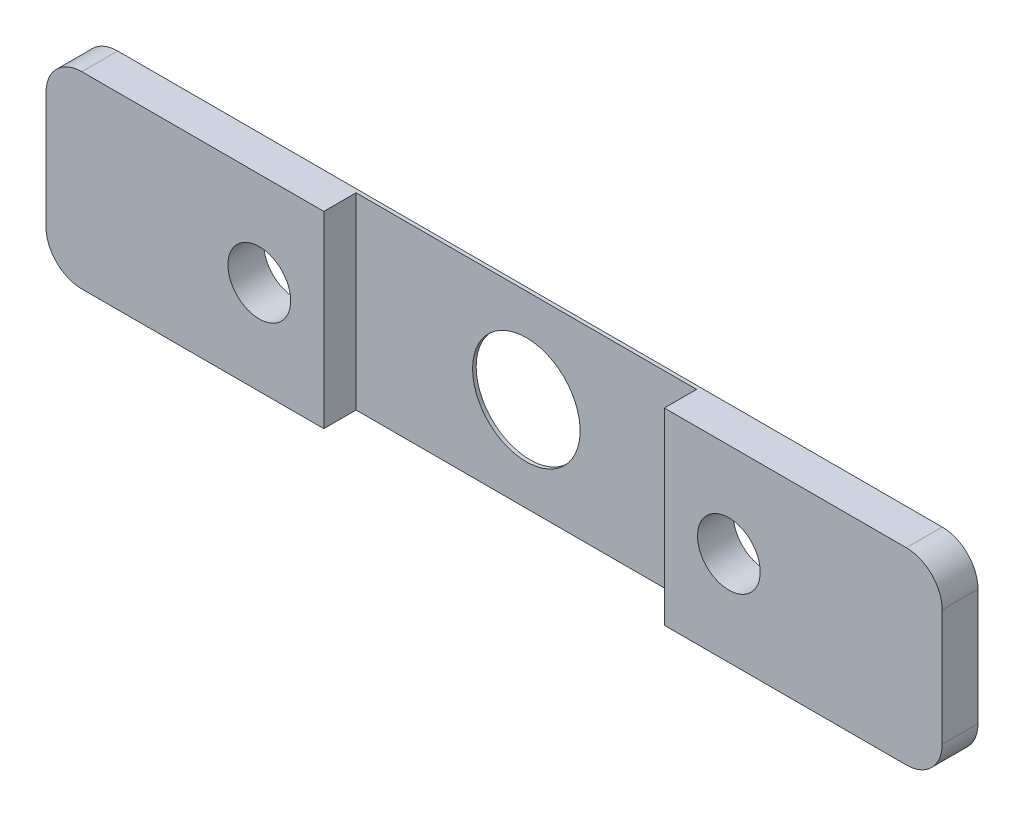
ISO-10303-21;
HEADER;
FILE_DESCRIPTION(('STEP AP214'),'2;1');
FILE_NAME('part.step','',(''),(''),'','','');
FILE_SCHEMA(('AUTOMOTIVE_DESIGN { 1 0 10303 214 1 1 1 1 }'));
ENDSEC;
DATA;
#1=APPLICATION_CONTEXT('core data for automotive mechanical design processes');
#2=APPLICATION_PROTOCOL_DEFINITION('international standard','automotive_design',2000,#1);
#3=PRODUCT_CONTEXT('',#1,'mechanical');
#4=PRODUCT('Part','Part','',(#3));
#5=PRODUCT_RELATED_PRODUCT_CATEGORY('part','',(#4));
#6=PRODUCT_DEFINITION_FORMATION('','',#4);
#7=PRODUCT_DEFINITION_CONTEXT('part definition',#1,'design');
#8=PRODUCT_DEFINITION('design','',#6,#7);
#9=PRODUCT_DEFINITION_SHAPE('','',#8);
#10=(LENGTH_UNIT() NAMED_UNIT(*) SI_UNIT(.MILLI.,.METRE.));
#11=(NAMED_UNIT(*) PLANE_ANGLE_UNIT() SI_UNIT($,.RADIAN.));
#12=(NAMED_UNIT(*) SI_UNIT($,.STERADIAN.) SOLID_ANGLE_UNIT());
#13=UNCERTAINTY_MEASURE_WITH_UNIT(LENGTH_MEASURE(1.E-05),#10,'distance_accuracy_value','');
#14=(GEOMETRIC_REPRESENTATION_CONTEXT(3) GLOBAL_UNCERTAINTY_ASSIGNED_CONTEXT((#13)) GLOBAL_UNIT_ASSIGNED_CONTEXT((#10,
#11,#12)) REPRESENTATION_CONTEXT('',''));
#15=CARTESIAN_POINT('',(0.,0.,0.));
#16=DIRECTION('',(0.,0.,1.));
#17=DIRECTION('',(1.,0.,0.));
#18=AXIS2_PLACEMENT_3D('',#15,#16,#17);
#19=CARTESIAN_POINT('',(0.,0.,2.));
#20=DIRECTION('',(0.,0.,-1.));
#21=DIRECTION('',(-1.,0.,0.));
#22=AXIS2_PLACEMENT_3D('',#19,#20,#21);
#23=PLANE('',#22);
#24=CARTESIAN_POINT('',(13.1,0.,2.));
#25=DIRECTION('',(0.,0.,1.));
#26=DIRECTION('',(1.,0.,0.));
#27=AXIS2_PLACEMENT_3D('',#24,#25,#26);
#28=CIRCLE('',#27,1.75);
#29=CARTESIAN_POINT('',(14.85,0.,2.));
#30=VERTEX_POINT('',#29);
#31=EDGE_CURVE('E164',#30,#30,#28,.T.);
#32=ORIENTED_EDGE('',*,*,#31,.F.);
#33=EDGE_LOOP('',(#32));
#34=FACE_BOUND('',#33,.T.);
#35=DIRECTION('',(-1.,0.,0.));
#36=VECTOR('',#35,1.);
#37=CARTESIAN_POINT('',(-25.,5.24999999999999,2.));
#38=LINE('',#37,#36);
#39=CARTESIAN_POINT('',(23.,5.24999999999999,2.));
#40=VERTEX_POINT('',#39);
#41=CARTESIAN_POINT('',(9.49999999999998,5.24999999999999,2.));
#42=VERTEX_POINT('',#41);
#43=EDGE_CURVE('E175',#40,#42,#38,.T.);
#44=ORIENTED_EDGE('',*,*,#43,.T.);
#45=DIRECTION('',(0.,1.,0.));
#46=VECTOR('',#45,1.);
#47=CARTESIAN_POINT('',(9.49999999999998,-5.24999999999999,2.));
#48=LINE('',#47,#46);
#49=CARTESIAN_POINT('',(9.49999999999998,-5.24999999999999,2.));
#50=VERTEX_POINT('',#49);
#51=EDGE_CURVE('E127',#50,#42,#48,.T.);
#52=ORIENTED_EDGE('',*,*,#51,.F.);
#53=DIRECTION('',(1.,0.,0.));
#54=VECTOR('',#53,1.);
#55=CARTESIAN_POINT('',(-25.,-5.25000000000001,2.));
#56=LINE('',#55,#54);
#57=CARTESIAN_POINT('',(23.,-5.24999999999999,2.));
#58=VERTEX_POINT('',#57);
#59=EDGE_CURVE('E56',#50,#58,#56,.T.);
#60=ORIENTED_EDGE('',*,*,#59,.T.);
#61=CARTESIAN_POINT('',(23.,-3.24999999999999,2.));
#62=DIRECTION('',(0.,0.,-1.));
#63=DIRECTION('',(-1.,0.,0.));
#64=AXIS2_PLACEMENT_3D('',#61,#62,#63);
#65=CIRCLE('',#64,2.);
#66=CARTESIAN_POINT('',(25.,-3.24999999999999,2.));
#67=VERTEX_POINT('',#66);
#68=EDGE_CURVE('E214',#58,#67,#65,.F.);
#69=ORIENTED_EDGE('',*,*,#68,.T.);
#70=DIRECTION('',(0.,1.,0.));
#71=VECTOR('',#70,1.);
#72=CARTESIAN_POINT('',(25.,-5.24999999999999,2.));
#73=LINE('',#72,#71);
#74=CARTESIAN_POINT('',(25.,3.24999999999999,2.));
#75=VERTEX_POINT('',#74);
#76=EDGE_CURVE('E170',#67,#75,#73,.T.);
#77=ORIENTED_EDGE('',*,*,#76,.T.);
#78=CARTESIAN_POINT('',(23.,3.24999999999999,2.));
#79=DIRECTION('',(0.,0.,-1.));
#80=DIRECTION('',(-1.,0.,0.));
#81=AXIS2_PLACEMENT_3D('',#78,#79,#80);
#82=CIRCLE('',#81,2.);
#83=EDGE_CURVE('E212',#75,#40,#82,.F.);
#84=ORIENTED_EDGE('',*,*,#83,.T.);
#85=EDGE_LOOP('',(#44,#52,#60,#69,#77,#84));
#86=FACE_BOUND('',#85,.T.);
#87=ADVANCED_FACE('F32',(#34,#86),#23,.F.);
#88=CARTESIAN_POINT('',(-23.,-5.25000000000001,2.));
#89=VERTEX_POINT('',#88);
#90=CARTESIAN_POINT('',(-9.50000000000002,-5.24999999999999,2.));
#91=VERTEX_POINT('',#90);
#92=EDGE_CURVE('E180',#89,#91,#56,.T.);
#93=ORIENTED_EDGE('',*,*,#92,.T.);
#94=DIRECTION('',(0.,-1.,0.));
#95=VECTOR('',#94,1.);
#96=CARTESIAN_POINT('',(-9.50000000000002,-5.24999999999999,2.));
#97=LINE('',#96,#95);
#98=CARTESIAN_POINT('',(-9.50000000000002,5.24999999999999,2.));
#99=VERTEX_POINT('',#98);
#100=EDGE_CURVE('E140',#99,#91,#97,.T.);
#101=ORIENTED_EDGE('',*,*,#100,.F.);
#102=CARTESIAN_POINT('',(-23.,5.24999999999999,2.));
#103=VERTEX_POINT('',#102);
#104=EDGE_CURVE('E173',#99,#103,#38,.T.);
#105=ORIENTED_EDGE('',*,*,#104,.T.);
#106=CARTESIAN_POINT('',(-23.,3.24999999999999,2.));
#107=DIRECTION('',(0.,0.,-1.));
#108=DIRECTION('',(-1.,0.,0.));
#109=AXIS2_PLACEMENT_3D('',#106,#107,#108);
#110=CIRCLE('',#109,2.);
#111=CARTESIAN_POINT('',(-25.,3.24999999999999,2.));
#112=VERTEX_POINT('',#111);
#113=EDGE_CURVE('E218',#103,#112,#110,.F.);
#114=ORIENTED_EDGE('',*,*,#113,.T.);
#115=DIRECTION('',(0.,-1.,0.));
#116=VECTOR('',#115,1.);
#117=CARTESIAN_POINT('',(-25.,-5.25000000000001,2.));
#118=LINE('',#117,#116);
#119=CARTESIAN_POINT('',(-25.,-3.25000000000001,2.));
#120=VERTEX_POINT('',#119);
#121=EDGE_CURVE('E177',#112,#120,#118,.T.);
#122=ORIENTED_EDGE('',*,*,#121,.T.);
#123=CARTESIAN_POINT('',(-23.,-3.25000000000001,2.));
#124=DIRECTION('',(0.,0.,-1.));
#125=DIRECTION('',(-1.,0.,0.));
#126=AXIS2_PLACEMENT_3D('',#123,#124,#125);
#127=CIRCLE('',#126,2.);
#128=EDGE_CURVE('E216',#120,#89,#127,.F.);
#129=ORIENTED_EDGE('',*,*,#128,.T.);
#130=EDGE_LOOP('',(#93,#101,#105,#114,#122,#129));
#131=FACE_BOUND('',#130,.T.);
#132=CARTESIAN_POINT('',(-13.1,0.,2.));
#133=DIRECTION('',(0.,0.,1.));
#134=DIRECTION('',(1.,0.,0.));
#135=AXIS2_PLACEMENT_3D('',#132,#133,#134);
#136=CIRCLE('',#135,1.75);
#137=CARTESIAN_POINT('',(-11.35,0.,2.));
#138=VERTEX_POINT('',#137);
#139=EDGE_CURVE('E158',#138,#138,#136,.T.);
#140=ORIENTED_EDGE('',*,*,#139,.F.);
#141=EDGE_LOOP('',(#140));
#142=FACE_BOUND('',#141,.T.);
#143=ADVANCED_FACE('F251',(#131,#142),#23,.F.);
#144=CARTESIAN_POINT('',(0.,0.,0.));
#145=DIRECTION('',(0.,0.,-1.));
#146=DIRECTION('',(-1.,0.,0.));
#147=AXIS2_PLACEMENT_3D('',#144,#145,#146);
#148=PLANE('',#147);
#149=CARTESIAN_POINT('',(0.,0.,0.));
#150=DIRECTION('',(0.,0.,-1.));
#151=DIRECTION('',(-1.,0.,0.));
#152=AXIS2_PLACEMENT_3D('',#149,#150,#151);
#153=CIRCLE('',#152,3.);
#154=CARTESIAN_POINT('',(-3.,0.,0.));
#155=VERTEX_POINT('',#154);
#156=EDGE_CURVE('E351',#155,#155,#153,.T.);
#157=ORIENTED_EDGE('',*,*,#156,.F.);
#158=EDGE_LOOP('',(#157));
#159=FACE_BOUND('',#158,.T.);
#160=CARTESIAN_POINT('',(13.1,0.,0.));
#161=DIRECTION('',(0.,0.,1.));
#162=DIRECTION('',(1.,0.,0.));
#163=AXIS2_PLACEMENT_3D('',#160,#161,#162);
#164=CIRCLE('',#163,1.75);
#165=CARTESIAN_POINT('',(14.85,0.,0.));
#166=VERTEX_POINT('',#165);
#167=EDGE_CURVE('E161',#166,#166,#164,.T.);
#168=ORIENTED_EDGE('',*,*,#167,.T.);
#169=EDGE_LOOP('',(#168));
#170=FACE_BOUND('',#169,.T.);
#171=DIRECTION('',(0.,-1.,0.));
#172=VECTOR('',#171,1.);
#173=CARTESIAN_POINT('',(-25.,-5.25000000000001,0.));
#174=LINE('',#173,#172);
#175=CARTESIAN_POINT('',(-25.,3.24999999999999,0.));
#176=VERTEX_POINT('',#175);
#177=CARTESIAN_POINT('',(-25.,-3.25000000000001,0.));
#178=VERTEX_POINT('',#177);
#179=EDGE_CURVE('E189',#176,#178,#174,.T.);
#180=ORIENTED_EDGE('',*,*,#179,.F.);
#181=CARTESIAN_POINT('',(-23.,3.24999999999999,0.));
#182=DIRECTION('',(0.,0.,-1.));
#183=DIRECTION('',(-1.,0.,0.));
#184=AXIS2_PLACEMENT_3D('',#181,#182,#183);
#185=CIRCLE('',#184,2.);
#186=CARTESIAN_POINT('',(-23.,5.24999999999999,0.));
#187=VERTEX_POINT('',#186);
#188=EDGE_CURVE('E204',#176,#187,#185,.T.);
#189=ORIENTED_EDGE('',*,*,#188,.T.);
#190=DIRECTION('',(-1.,0.,0.));
#191=VECTOR('',#190,1.);
#192=CARTESIAN_POINT('',(-25.,5.24999999999999,0.));
#193=LINE('',#192,#191);
#194=CARTESIAN_POINT('',(23.,5.24999999999999,0.));
#195=VERTEX_POINT('',#194);
#196=EDGE_CURVE('E186',#195,#187,#193,.T.);
#197=ORIENTED_EDGE('',*,*,#196,.F.);
#198=CARTESIAN_POINT('',(23.,3.24999999999999,0.));
#199=DIRECTION('',(0.,0.,-1.));
#200=DIRECTION('',(-1.,0.,0.));
#201=AXIS2_PLACEMENT_3D('',#198,#199,#200);
#202=CIRCLE('',#201,2.);
#203=CARTESIAN_POINT('',(25.,3.24999999999999,0.));
#204=VERTEX_POINT('',#203);
#205=EDGE_CURVE('E198',#195,#204,#202,.T.);
#206=ORIENTED_EDGE('',*,*,#205,.T.);
#207=DIRECTION('',(0.,1.,0.));
#208=VECTOR('',#207,1.);
#209=CARTESIAN_POINT('',(25.,-5.24999999999999,0.));
#210=LINE('',#209,#208);
#211=CARTESIAN_POINT('',(25.,-3.24999999999999,0.));
#212=VERTEX_POINT('',#211);
#213=EDGE_CURVE('E167',#212,#204,#210,.T.);
#214=ORIENTED_EDGE('',*,*,#213,.F.);
#215=CARTESIAN_POINT('',(23.,-3.24999999999999,0.));
#216=DIRECTION('',(0.,0.,-1.));
#217=DIRECTION('',(-1.,0.,0.));
#218=AXIS2_PLACEMENT_3D('',#215,#216,#217);
#219=CIRCLE('',#218,2.);
#220=CARTESIAN_POINT('',(23.,-5.24999999999999,0.));
#221=VERTEX_POINT('',#220);
#222=EDGE_CURVE('E200',#212,#221,#219,.T.);
#223=ORIENTED_EDGE('',*,*,#222,.T.);
#224=DIRECTION('',(1.,0.,0.));
#225=VECTOR('',#224,1.);
#226=CARTESIAN_POINT('',(-25.,-5.25000000000001,0.));
#227=LINE('',#226,#225);
#228=CARTESIAN_POINT('',(-23.,-5.25000000000001,0.));
#229=VERTEX_POINT('',#228);
#230=EDGE_CURVE('E174',#229,#221,#227,.T.);
#231=ORIENTED_EDGE('',*,*,#230,.F.);
#232=CARTESIAN_POINT('',(-23.,-3.25000000000001,0.));
#233=DIRECTION('',(0.,0.,-1.));
#234=DIRECTION('',(-1.,0.,0.));
#235=AXIS2_PLACEMENT_3D('',#232,#233,#234);
#236=CIRCLE('',#235,2.);
#237=EDGE_CURVE('E202',#229,#178,#236,.T.);
#238=ORIENTED_EDGE('',*,*,#237,.T.);
#239=EDGE_LOOP('',(#180,#189,#197,#206,#214,#223,#231,#238));
#240=FACE_BOUND('',#239,.T.);
#241=CARTESIAN_POINT('',(-13.1,0.,0.));
#242=DIRECTION('',(0.,0.,1.));
#243=DIRECTION('',(1.,0.,0.));
#244=AXIS2_PLACEMENT_3D('',#241,#242,#243);
#245=CIRCLE('',#244,1.75);
#246=CARTESIAN_POINT('',(-11.35,0.,0.));
#247=VERTEX_POINT('',#246);
#248=EDGE_CURVE('E153',#247,#247,#245,.T.);
#249=ORIENTED_EDGE('',*,*,#248,.T.);
#250=EDGE_LOOP('',(#249));
#251=FACE_BOUND('',#250,.T.);
#252=ADVANCED_FACE('F239',(#159,#170,#240,#251),#148,.T.);
#253=CARTESIAN_POINT('',(25.,-5.24999999999999,2.));
#254=DIRECTION('',(-1.,0.,0.));
#255=DIRECTION('',(0.,0.,1.));
#256=AXIS2_PLACEMENT_3D('',#253,#254,#255);
#257=PLANE('',#256);
#258=ORIENTED_EDGE('',*,*,#76,.F.);
#259=DIRECTION('',(0.,0.,-1.));
#260=VECTOR('',#259,1.);
#261=CARTESIAN_POINT('',(25.,-3.24999999999999,2.));
#262=LINE('',#261,#260);
#263=EDGE_CURVE('E11',#67,#212,#262,.T.);
#264=ORIENTED_EDGE('',*,*,#263,.T.);
#265=ORIENTED_EDGE('',*,*,#213,.T.);
#266=DIRECTION('',(0.,0.,-1.));
#267=VECTOR('',#266,1.);
#268=CARTESIAN_POINT('',(25.,3.24999999999999,2.));
#269=LINE('',#268,#267);
#270=EDGE_CURVE('E41',#204,#75,#269,.F.);
#271=ORIENTED_EDGE('',*,*,#270,.T.);
#272=EDGE_LOOP('',(#258,#264,#265,#271));
#273=FACE_BOUND('',#272,.T.);
#274=ADVANCED_FACE('F228',(#273),#257,.F.);
#275=CARTESIAN_POINT('',(-25.,5.24999999999999,2.));
#276=DIRECTION('',(0.,-1.,0.));
#277=DIRECTION('',(1.,0.,0.));
#278=AXIS2_PLACEMENT_3D('',#275,#276,#277);
#279=PLANE('',#278);
#280=DIRECTION('',(-1.,0.,0.));
#281=VECTOR('',#280,1.);
#282=CARTESIAN_POINT('',(-9.50000000000002,5.24999999999999,0.2));
#283=LINE('',#282,#281);
#284=CARTESIAN_POINT('',(9.49999999999998,5.24999999999999,0.2));
#285=VERTEX_POINT('',#284);
#286=CARTESIAN_POINT('',(-9.50000000000002,5.24999999999999,0.2));
#287=VERTEX_POINT('',#286);
#288=EDGE_CURVE('E136',#285,#287,#283,.T.);
#289=ORIENTED_EDGE('',*,*,#288,.F.);
#290=DIRECTION('',(0.,0.,1.));
#291=VECTOR('',#290,1.);
#292=CARTESIAN_POINT('',(9.49999999999998,5.24999999999999,0.2));
#293=LINE('',#292,#291);
#294=EDGE_CURVE('E123',#285,#42,#293,.T.);
#295=ORIENTED_EDGE('',*,*,#294,.T.);
#296=ORIENTED_EDGE('',*,*,#43,.F.);
#297=DIRECTION('',(0.,0.,-1.));
#298=VECTOR('',#297,1.);
#299=CARTESIAN_POINT('',(23.,5.24999999999999,2.));
#300=LINE('',#299,#298);
#301=EDGE_CURVE('E206',#40,#195,#300,.T.);
#302=ORIENTED_EDGE('',*,*,#301,.T.);
#303=ORIENTED_EDGE('',*,*,#196,.T.);
#304=DIRECTION('',(0.,0.,-1.));
#305=VECTOR('',#304,1.);
#306=CARTESIAN_POINT('',(-23.,5.24999999999999,2.));
#307=LINE('',#306,#305);
#308=EDGE_CURVE('E209',#187,#103,#307,.F.);
#309=ORIENTED_EDGE('',*,*,#308,.T.);
#310=ORIENTED_EDGE('',*,*,#104,.F.);
#311=DIRECTION('',(0.,0.,1.));
#312=VECTOR('',#311,1.);
#313=CARTESIAN_POINT('',(-9.50000000000002,5.24999999999999,0.2));
#314=LINE('',#313,#312);
#315=EDGE_CURVE('E132',#287,#99,#314,.T.);
#316=ORIENTED_EDGE('',*,*,#315,.F.);
#317=EDGE_LOOP('',(#289,#295,#296,#302,#303,#309,#310,#316));
#318=FACE_BOUND('',#317,.T.);
#319=ADVANCED_FACE('F142',(#318),#279,.F.);
#320=CARTESIAN_POINT('',(-25.,-5.25000000000001,2.));
#321=DIRECTION('',(1.,0.,0.));
#322=DIRECTION('',(0.,0.,-1.));
#323=AXIS2_PLACEMENT_3D('',#320,#321,#322);
#324=PLANE('',#323);
#325=ORIENTED_EDGE('',*,*,#121,.F.);
#326=DIRECTION('',(0.,0.,-1.));
#327=VECTOR('',#326,1.);
#328=CARTESIAN_POINT('',(-25.,3.24999999999999,2.));
#329=LINE('',#328,#327);
#330=EDGE_CURVE('E195',#112,#176,#329,.T.);
#331=ORIENTED_EDGE('',*,*,#330,.T.);
#332=ORIENTED_EDGE('',*,*,#179,.T.);
#333=DIRECTION('',(0.,0.,-1.));
#334=VECTOR('',#333,1.);
#335=CARTESIAN_POINT('',(-25.,-3.25000000000001,2.));
#336=LINE('',#335,#334);
#337=EDGE_CURVE('E183',#178,#120,#336,.F.);
#338=ORIENTED_EDGE('',*,*,#337,.T.);
#339=EDGE_LOOP('',(#325,#331,#332,#338));
#340=FACE_BOUND('',#339,.T.);
#341=ADVANCED_FACE('F247',(#340),#324,.F.);
#342=CARTESIAN_POINT('',(-25.,-5.25000000000001,2.));
#343=DIRECTION('',(0.,1.,0.));
#344=DIRECTION('',(-1.,0.,0.));
#345=AXIS2_PLACEMENT_3D('',#342,#343,#344);
#346=PLANE('',#345);
#347=ORIENTED_EDGE('',*,*,#59,.F.);
#348=DIRECTION('',(0.,0.,1.));
#349=VECTOR('',#348,1.);
#350=CARTESIAN_POINT('',(9.49999999999998,-5.24999999999999,0.2));
#351=LINE('',#350,#349);
#352=CARTESIAN_POINT('',(9.49999999999998,-5.24999999999999,0.2));
#353=VERTEX_POINT('',#352);
#354=EDGE_CURVE('E151',#353,#50,#351,.T.);
#355=ORIENTED_EDGE('',*,*,#354,.F.);
#356=DIRECTION('',(1.,0.,0.));
#357=VECTOR('',#356,1.);
#358=CARTESIAN_POINT('',(-9.50000000000002,-5.24999999999999,0.2));
#359=LINE('',#358,#357);
#360=CARTESIAN_POINT('',(-9.50000000000002,-5.25,0.2));
#361=VERTEX_POINT('',#360);
#362=EDGE_CURVE('E133',#361,#353,#359,.T.);
#363=ORIENTED_EDGE('',*,*,#362,.F.);
#364=DIRECTION('',(0.,0.,1.));
#365=VECTOR('',#364,1.);
#366=CARTESIAN_POINT('',(-9.50000000000002,-5.24999999999999,0.2));
#367=LINE('',#366,#365);
#368=EDGE_CURVE('E154',#361,#91,#367,.T.);
#369=ORIENTED_EDGE('',*,*,#368,.T.);
#370=ORIENTED_EDGE('',*,*,#92,.F.);
#371=DIRECTION('',(0.,0.,-1.));
#372=VECTOR('',#371,1.);
#373=CARTESIAN_POINT('',(-23.,-5.25000000000001,2.));
#374=LINE('',#373,#372);
#375=EDGE_CURVE('E222',#89,#229,#374,.T.);
#376=ORIENTED_EDGE('',*,*,#375,.T.);
#377=ORIENTED_EDGE('',*,*,#230,.T.);
#378=DIRECTION('',(0.,0.,-1.));
#379=VECTOR('',#378,1.);
#380=CARTESIAN_POINT('',(23.,-5.24999999999999,2.));
#381=LINE('',#380,#379);
#382=EDGE_CURVE('E220',#221,#58,#381,.F.);
#383=ORIENTED_EDGE('',*,*,#382,.T.);
#384=EDGE_LOOP('',(#347,#355,#363,#369,#370,#376,#377,#383));
#385=FACE_BOUND('',#384,.T.);
#386=ADVANCED_FACE('F259',(#385),#346,.F.);
#387=CARTESIAN_POINT('',(13.1,0.,2.));
#388=DIRECTION('',(0.,0.,-1.));
#389=DIRECTION('',(-1.,0.,0.));
#390=AXIS2_PLACEMENT_3D('',#387,#388,#389);
#391=CYLINDRICAL_SURFACE('',#390,1.75);
#392=ORIENTED_EDGE('',*,*,#31,.T.);
#393=EDGE_LOOP('',(#392));
#394=FACE_BOUND('',#393,.T.);
#395=ORIENTED_EDGE('',*,*,#167,.F.);
#396=EDGE_LOOP('',(#395));
#397=FACE_BOUND('',#396,.T.);
#398=ADVANCED_FACE('F285',(#394,#397),#391,.F.);
#399=CARTESIAN_POINT('',(-13.1,0.,2.));
#400=DIRECTION('',(0.,0.,-1.));
#401=DIRECTION('',(-1.,0.,0.));
#402=AXIS2_PLACEMENT_3D('',#399,#400,#401);
#403=CYLINDRICAL_SURFACE('',#402,1.75);
#404=ORIENTED_EDGE('',*,*,#139,.T.);
#405=EDGE_LOOP('',(#404));
#406=FACE_BOUND('',#405,.T.);
#407=ORIENTED_EDGE('',*,*,#248,.F.);
#408=EDGE_LOOP('',(#407));
#409=FACE_BOUND('',#408,.T.);
#410=ADVANCED_FACE('F300',(#406,#409),#403,.F.);
#411=CARTESIAN_POINT('',(-23.,3.24999999999999,2.));
#412=DIRECTION('',(0.,0.,-1.));
#413=DIRECTION('',(-1.,0.,0.));
#414=AXIS2_PLACEMENT_3D('',#411,#412,#413);
#415=CYLINDRICAL_SURFACE('',#414,2.);
#416=ORIENTED_EDGE('',*,*,#113,.F.);
#417=ORIENTED_EDGE('',*,*,#308,.F.);
#418=ORIENTED_EDGE('',*,*,#188,.F.);
#419=ORIENTED_EDGE('',*,*,#330,.F.);
#420=EDGE_LOOP('',(#416,#417,#418,#419));
#421=FACE_BOUND('',#420,.T.);
#422=ADVANCED_FACE('F244',(#421),#415,.T.);
#423=CARTESIAN_POINT('',(-23.,-3.25000000000001,2.));
#424=DIRECTION('',(0.,0.,-1.));
#425=DIRECTION('',(-1.,0.,0.));
#426=AXIS2_PLACEMENT_3D('',#423,#424,#425);
#427=CYLINDRICAL_SURFACE('',#426,2.);
#428=ORIENTED_EDGE('',*,*,#128,.F.);
#429=ORIENTED_EDGE('',*,*,#337,.F.);
#430=ORIENTED_EDGE('',*,*,#237,.F.);
#431=ORIENTED_EDGE('',*,*,#375,.F.);
#432=EDGE_LOOP('',(#428,#429,#430,#431));
#433=FACE_BOUND('',#432,.T.);
#434=ADVANCED_FACE('F256',(#433),#427,.T.);
#435=CARTESIAN_POINT('',(23.,-3.24999999999999,2.));
#436=DIRECTION('',(0.,0.,-1.));
#437=DIRECTION('',(-1.,0.,0.));
#438=AXIS2_PLACEMENT_3D('',#435,#436,#437);
#439=CYLINDRICAL_SURFACE('',#438,2.);
#440=ORIENTED_EDGE('',*,*,#68,.F.);
#441=ORIENTED_EDGE('',*,*,#382,.F.);
#442=ORIENTED_EDGE('',*,*,#222,.F.);
#443=ORIENTED_EDGE('',*,*,#263,.F.);
#444=EDGE_LOOP('',(#440,#441,#442,#443));
#445=FACE_BOUND('',#444,.T.);
#446=ADVANCED_FACE('F262',(#445),#439,.T.);
#447=CARTESIAN_POINT('',(23.,3.24999999999999,2.));
#448=DIRECTION('',(0.,0.,-1.));
#449=DIRECTION('',(-1.,0.,0.));
#450=AXIS2_PLACEMENT_3D('',#447,#448,#449);
#451=CYLINDRICAL_SURFACE('',#450,2.);
#452=ORIENTED_EDGE('',*,*,#83,.F.);
#453=ORIENTED_EDGE('',*,*,#270,.F.);
#454=ORIENTED_EDGE('',*,*,#205,.F.);
#455=ORIENTED_EDGE('',*,*,#301,.F.);
#456=EDGE_LOOP('',(#452,#453,#454,#455));
#457=FACE_BOUND('',#456,.T.);
#458=ADVANCED_FACE('F34',(#457),#451,.T.);
#459=CARTESIAN_POINT('',(9.49999999999998,-5.24999999999999,0.2));
#460=DIRECTION('',(1.,0.,0.));
#461=DIRECTION('',(0.,0.,-1.));
#462=AXIS2_PLACEMENT_3D('',#459,#460,#461);
#463=PLANE('',#462);
#464=ORIENTED_EDGE('',*,*,#51,.T.);
#465=ORIENTED_EDGE('',*,*,#294,.F.);
#466=DIRECTION('',(0.,1.,0.));
#467=VECTOR('',#466,1.);
#468=CARTESIAN_POINT('',(9.49999999999998,-5.24999999999999,0.2));
#469=LINE('',#468,#467);
#470=EDGE_CURVE('E126',#353,#285,#469,.T.);
#471=ORIENTED_EDGE('',*,*,#470,.F.);
#472=ORIENTED_EDGE('',*,*,#354,.T.);
#473=EDGE_LOOP('',(#464,#465,#471,#472));
#474=FACE_BOUND('',#473,.T.);
#475=ADVANCED_FACE('F125',(#474),#463,.F.);
#476=CARTESIAN_POINT('',(-9.50000000000002,-5.24999999999999,0.2));
#477=DIRECTION('',(-1.,0.,0.));
#478=DIRECTION('',(0.,0.,1.));
#479=AXIS2_PLACEMENT_3D('',#476,#477,#478);
#480=PLANE('',#479);
#481=ORIENTED_EDGE('',*,*,#100,.T.);
#482=ORIENTED_EDGE('',*,*,#368,.F.);
#483=DIRECTION('',(0.,-1.,0.));
#484=VECTOR('',#483,1.);
#485=CARTESIAN_POINT('',(-9.50000000000002,-5.24999999999999,0.2));
#486=LINE('',#485,#484);
#487=EDGE_CURVE('E48',#287,#361,#486,.T.);
#488=ORIENTED_EDGE('',*,*,#487,.F.);
#489=ORIENTED_EDGE('',*,*,#315,.T.);
#490=EDGE_LOOP('',(#481,#482,#488,#489));
#491=FACE_BOUND('',#490,.T.);
#492=ADVANCED_FACE('F265',(#491),#480,.F.);
#493=CARTESIAN_POINT('',(0.,0.,0.2));
#494=DIRECTION('',(0.,0.,-1.));
#495=DIRECTION('',(-1.,0.,0.));
#496=AXIS2_PLACEMENT_3D('',#493,#494,#495);
#497=PLANE('',#496);
#498=CARTESIAN_POINT('',(0.,0.,0.2));
#499=DIRECTION('',(0.,0.,-1.));
#500=DIRECTION('',(-1.,0.,0.));
#501=AXIS2_PLACEMENT_3D('',#498,#499,#500);
#502=CIRCLE('',#501,3.);
#503=CARTESIAN_POINT('',(-3.,0.,0.2));
#504=VERTEX_POINT('',#503);
#505=EDGE_CURVE('E36',#504,#504,#502,.T.);
#506=ORIENTED_EDGE('',*,*,#505,.T.);
#507=EDGE_LOOP('',(#506));
#508=FACE_BOUND('',#507,.T.);
#509=ORIENTED_EDGE('',*,*,#470,.T.);
#510=ORIENTED_EDGE('',*,*,#288,.T.);
#511=ORIENTED_EDGE('',*,*,#487,.T.);
#512=ORIENTED_EDGE('',*,*,#362,.T.);
#513=EDGE_LOOP('',(#509,#510,#511,#512));
#514=FACE_BOUND('',#513,.T.);
#515=ADVANCED_FACE('F135',(#508,#514),#497,.F.);
#516=CARTESIAN_POINT('',(0.,0.,2.));
#517=DIRECTION('',(0.,0.,-1.));
#518=DIRECTION('',(-1.,0.,0.));
#519=AXIS2_PLACEMENT_3D('',#516,#517,#518);
#520=CYLINDRICAL_SURFACE('',#519,3.);
#521=ORIENTED_EDGE('',*,*,#156,.T.);
#522=EDGE_LOOP('',(#521));
#523=FACE_BOUND('',#522,.T.);
#524=ORIENTED_EDGE('',*,*,#505,.F.);
#525=EDGE_LOOP('',(#524));
#526=FACE_BOUND('',#525,.T.);
#527=ADVANCED_FACE('F272',(#523,#526),#520,.F.);
#528=CLOSED_SHELL('',(#87,#143,#252,#274,#319,#341,#386,#398,#410,#422,#434,#446,#458,#475,#492,
#515,#527));
#529=MANIFOLD_SOLID_BREP('B2',#528);
#530=ADVANCED_BREP_SHAPE_REPRESENTATION('',(#18,#529),#14);
#531=SHAPE_DEFINITION_REPRESENTATION(#9,#530);
ENDSEC;
END-ISO-10303-21;
